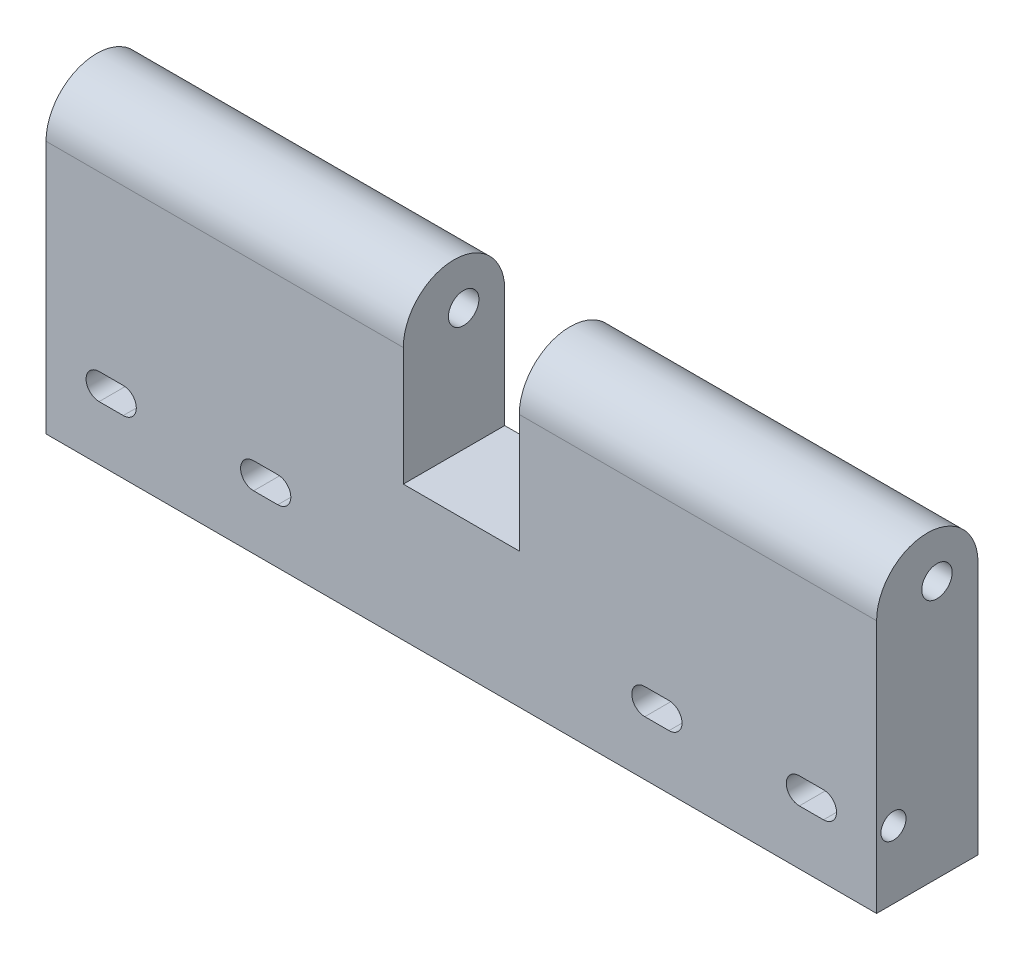
ISO-10303-21;
HEADER;
FILE_DESCRIPTION(('STEP AP214'),'2;1');
FILE_NAME('part.step','',(''),(''),'','','');
FILE_SCHEMA(('AUTOMOTIVE_DESIGN { 1 0 10303 214 1 1 1 1 }'));
ENDSEC;
DATA;
#1=APPLICATION_CONTEXT('core data for automotive mechanical design processes');
#2=APPLICATION_PROTOCOL_DEFINITION('international standard','automotive_design',2000,#1);
#3=PRODUCT_CONTEXT('',#1,'mechanical');
#4=PRODUCT('Part','Part','',(#3));
#5=PRODUCT_RELATED_PRODUCT_CATEGORY('part','',(#4));
#6=PRODUCT_DEFINITION_FORMATION('','',#4);
#7=PRODUCT_DEFINITION_CONTEXT('part definition',#1,'design');
#8=PRODUCT_DEFINITION('design','',#6,#7);
#9=PRODUCT_DEFINITION_SHAPE('','',#8);
#10=(LENGTH_UNIT() NAMED_UNIT(*) SI_UNIT(.MILLI.,.METRE.));
#11=(NAMED_UNIT(*) PLANE_ANGLE_UNIT() SI_UNIT($,.RADIAN.));
#12=(NAMED_UNIT(*) SI_UNIT($,.STERADIAN.) SOLID_ANGLE_UNIT());
#13=UNCERTAINTY_MEASURE_WITH_UNIT(LENGTH_MEASURE(1.E-05),#10,'distance_accuracy_value','');
#14=(GEOMETRIC_REPRESENTATION_CONTEXT(3) GLOBAL_UNCERTAINTY_ASSIGNED_CONTEXT((#13)) GLOBAL_UNIT_ASSIGNED_CONTEXT((#10,
#11,#12)) REPRESENTATION_CONTEXT('',''));
#15=CARTESIAN_POINT('',(0.,0.,0.));
#16=DIRECTION('',(0.,0.,1.));
#17=DIRECTION('',(1.,0.,0.));
#18=AXIS2_PLACEMENT_3D('',#15,#16,#17);
#19=CARTESIAN_POINT('',(-86.01,-14.0000000000001,21.));
#20=DIRECTION('',(1.,0.,0.));
#21=DIRECTION('',(0.,1.,0.));
#22=AXIS2_PLACEMENT_3D('',#19,#20,#21);
#23=PLANE('',#22);
#24=CARTESIAN_POINT('',(-86.01,0.,17.5));
#25=DIRECTION('',(-1.,0.,0.));
#26=DIRECTION('',(0.,-1.,0.));
#27=AXIS2_PLACEMENT_3D('',#24,#25,#26);
#28=CIRCLE('',#27,2.6);
#29=CARTESIAN_POINT('',(-86.01,-2.60000000000002,17.5));
#30=VERTEX_POINT('',#29);
#31=EDGE_CURVE('E431',#30,#30,#28,.T.);
#32=ORIENTED_EDGE('',*,*,#31,.F.);
#33=EDGE_LOOP('',(#32));
#34=FACE_BOUND('',#33,.T.);
#35=CARTESIAN_POINT('',(-86.01,39.3500000000002,8.50016556051523));
#36=DIRECTION('',(1.,0.,0.));
#37=DIRECTION('',(0.,0.,-1.));
#38=AXIS2_PLACEMENT_3D('',#35,#36,#37);
#39=CIRCLE('',#38,3.15);
#40=CARTESIAN_POINT('',(-86.01,39.3500000000002,5.35016556051523));
#41=VERTEX_POINT('',#40);
#42=EDGE_CURVE('E434',#41,#41,#39,.T.);
#43=ORIENTED_EDGE('',*,*,#42,.T.);
#44=EDGE_LOOP('',(#43));
#45=FACE_BOUND('',#44,.T.);
#46=DIRECTION('',(0.,-1.,0.));
#47=VECTOR('',#46,1.);
#48=CARTESIAN_POINT('',(-86.01,-14.0000000000001,21.));
#49=LINE('',#48,#47);
#50=CARTESIAN_POINT('',(-86.01,38.5000000000001,21.));
#51=VERTEX_POINT('',#50);
#52=CARTESIAN_POINT('',(-86.01,-14.0000000000001,21.));
#53=VERTEX_POINT('',#52);
#54=EDGE_CURVE('E213',#51,#53,#49,.T.);
#55=ORIENTED_EDGE('',*,*,#54,.F.);
#56=CARTESIAN_POINT('',(-86.01,38.5000000000001,10.5));
#57=DIRECTION('',(1.,0.,0.));
#58=DIRECTION('',(0.,0.,-1.));
#59=AXIS2_PLACEMENT_3D('',#56,#57,#58);
#60=CIRCLE('',#59,10.5);
#61=CARTESIAN_POINT('',(-86.01,38.5000000000001,0.));
#62=VERTEX_POINT('',#61);
#63=EDGE_CURVE('E198',#62,#51,#60,.T.);
#64=ORIENTED_EDGE('',*,*,#63,.F.);
#65=DIRECTION('',(0.,-1.,0.));
#66=VECTOR('',#65,1.);
#67=CARTESIAN_POINT('',(-86.01,-14.0000000000001,0.));
#68=LINE('',#67,#66);
#69=CARTESIAN_POINT('',(-86.01,-14.0000000000001,0.));
#70=VERTEX_POINT('',#69);
#71=EDGE_CURVE('E235',#62,#70,#68,.T.);
#72=ORIENTED_EDGE('',*,*,#71,.T.);
#73=DIRECTION('',(0.,0.,-1.));
#74=VECTOR('',#73,1.);
#75=CARTESIAN_POINT('',(-86.01,-14.0000000000001,21.));
#76=LINE('',#75,#74);
#77=EDGE_CURVE('E11',#53,#70,#76,.T.);
#78=ORIENTED_EDGE('',*,*,#77,.F.);
#79=EDGE_LOOP('',(#55,#64,#72,#78));
#80=FACE_BOUND('',#79,.T.);
#81=ADVANCED_FACE('F33',(#34,#45,#80),#23,.F.);
#82=CARTESIAN_POINT('',(86.01,-14.,21.));
#83=DIRECTION('',(-1.,0.,0.));
#84=DIRECTION('',(0.,0.,1.));
#85=AXIS2_PLACEMENT_3D('',#82,#83,#84);
#86=PLANE('',#85);
#87=CARTESIAN_POINT('',(86.01,1.14058058922876E-13,17.5000000000007));
#88=DIRECTION('',(1.,0.,0.));
#89=DIRECTION('',(0.,0.,-1.));
#90=AXIS2_PLACEMENT_3D('',#87,#88,#89);
#91=CIRCLE('',#90,2.6);
#92=CARTESIAN_POINT('',(86.01,1.14058058922876E-13,14.9000000000007));
#93=VERTEX_POINT('',#92);
#94=EDGE_CURVE('E444',#93,#93,#91,.T.);
#95=ORIENTED_EDGE('',*,*,#94,.F.);
#96=EDGE_LOOP('',(#95));
#97=FACE_BOUND('',#96,.T.);
#98=CARTESIAN_POINT('',(86.01,39.3500000000002,8.50016556051523));
#99=DIRECTION('',(1.,0.,0.));
#100=DIRECTION('',(0.,0.,-1.));
#101=AXIS2_PLACEMENT_3D('',#98,#99,#100);
#102=CIRCLE('',#101,3.15);
#103=CARTESIAN_POINT('',(86.01,39.3500000000002,5.35016556051523));
#104=VERTEX_POINT('',#103);
#105=EDGE_CURVE('E436',#104,#104,#102,.T.);
#106=ORIENTED_EDGE('',*,*,#105,.F.);
#107=EDGE_LOOP('',(#106));
#108=FACE_BOUND('',#107,.T.);
#109=CARTESIAN_POINT('',(86.01,38.5000000000001,10.5));
#110=DIRECTION('',(1.,0.,0.));
#111=DIRECTION('',(0.,0.,-1.));
#112=AXIS2_PLACEMENT_3D('',#109,#110,#111);
#113=CIRCLE('',#112,10.5);
#114=CARTESIAN_POINT('',(86.01,38.5000000000001,0.));
#115=VERTEX_POINT('',#114);
#116=CARTESIAN_POINT('',(86.01,38.5000000000001,21.));
#117=VERTEX_POINT('',#116);
#118=EDGE_CURVE('E209',#115,#117,#113,.T.);
#119=ORIENTED_EDGE('',*,*,#118,.T.);
#120=DIRECTION('',(0.,1.,0.));
#121=VECTOR('',#120,1.);
#122=CARTESIAN_POINT('',(86.01,-14.,21.));
#123=LINE('',#122,#121);
#124=CARTESIAN_POINT('',(86.01,-14.,21.));
#125=VERTEX_POINT('',#124);
#126=EDGE_CURVE('E222',#125,#117,#123,.T.);
#127=ORIENTED_EDGE('',*,*,#126,.F.);
#128=DIRECTION('',(0.,0.,-1.));
#129=VECTOR('',#128,1.);
#130=CARTESIAN_POINT('',(86.01,-14.,21.));
#131=LINE('',#130,#129);
#132=CARTESIAN_POINT('',(86.01,-14.,0.));
#133=VERTEX_POINT('',#132);
#134=EDGE_CURVE('E41',#125,#133,#131,.T.);
#135=ORIENTED_EDGE('',*,*,#134,.T.);
#136=DIRECTION('',(0.,1.,0.));
#137=VECTOR('',#136,1.);
#138=CARTESIAN_POINT('',(86.01,-14.,0.));
#139=LINE('',#138,#137);
#140=EDGE_CURVE('E225',#133,#115,#139,.T.);
#141=ORIENTED_EDGE('',*,*,#140,.T.);
#142=EDGE_LOOP('',(#119,#127,#135,#141));
#143=FACE_BOUND('',#142,.T.);
#144=ADVANCED_FACE('F246',(#97,#108,#143),#86,.F.);
#145=CARTESIAN_POINT('',(-12.01,49.,0.));
#146=DIRECTION('',(-1.,0.,0.));
#147=DIRECTION('',(0.,-1.,0.));
#148=AXIS2_PLACEMENT_3D('',#145,#146,#147);
#149=PLANE('',#148);
#150=CARTESIAN_POINT('',(-12.01,39.3500000000002,8.50016556051523));
#151=DIRECTION('',(-1.,0.,0.));
#152=DIRECTION('',(0.,-1.,0.));
#153=AXIS2_PLACEMENT_3D('',#150,#151,#152);
#154=CIRCLE('',#153,3.15);
#155=CARTESIAN_POINT('',(-12.01,36.2000000000002,8.50016556051523));
#156=VERTEX_POINT('',#155);
#157=EDGE_CURVE('E439',#156,#156,#154,.T.);
#158=ORIENTED_EDGE('',*,*,#157,.T.);
#159=EDGE_LOOP('',(#158));
#160=FACE_BOUND('',#159,.T.);
#161=CARTESIAN_POINT('',(-12.01,38.5000000000001,10.5));
#162=DIRECTION('',(-1.,0.,0.));
#163=DIRECTION('',(0.,-1.,0.));
#164=AXIS2_PLACEMENT_3D('',#161,#162,#163);
#165=CIRCLE('',#164,10.5);
#166=CARTESIAN_POINT('',(-12.01,38.5000000000001,21.));
#167=VERTEX_POINT('',#166);
#168=CARTESIAN_POINT('',(-12.01,38.5000000000001,0.));
#169=VERTEX_POINT('',#168);
#170=EDGE_CURVE('E260',#167,#169,#165,.T.);
#171=ORIENTED_EDGE('',*,*,#170,.F.);
#172=DIRECTION('',(0.,-1.,0.));
#173=VECTOR('',#172,1.);
#174=CARTESIAN_POINT('',(-12.01,49.,21.));
#175=LINE('',#174,#173);
#176=CARTESIAN_POINT('',(-12.01,14.,21.));
#177=VERTEX_POINT('',#176);
#178=EDGE_CURVE('E215',#167,#177,#175,.T.);
#179=ORIENTED_EDGE('',*,*,#178,.T.);
#180=DIRECTION('',(0.,0.,-1.));
#181=VECTOR('',#180,1.);
#182=CARTESIAN_POINT('',(-12.01,14.,0.));
#183=LINE('',#182,#181);
#184=CARTESIAN_POINT('',(-12.01,14.,0.));
#185=VERTEX_POINT('',#184);
#186=EDGE_CURVE('E266',#177,#185,#183,.T.);
#187=ORIENTED_EDGE('',*,*,#186,.T.);
#188=DIRECTION('',(0.,-1.,0.));
#189=VECTOR('',#188,1.);
#190=CARTESIAN_POINT('',(-12.01,49.,0.));
#191=LINE('',#190,#189);
#192=EDGE_CURVE('E269',#169,#185,#191,.T.);
#193=ORIENTED_EDGE('',*,*,#192,.F.);
#194=EDGE_LOOP('',(#171,#179,#187,#193));
#195=FACE_BOUND('',#194,.T.);
#196=ADVANCED_FACE('F425',(#160,#195),#149,.F.);
#197=CARTESIAN_POINT('',(12.01,49.,0.));
#198=DIRECTION('',(1.,0.,0.));
#199=DIRECTION('',(0.,1.,0.));
#200=AXIS2_PLACEMENT_3D('',#197,#198,#199);
#201=PLANE('',#200);
#202=CARTESIAN_POINT('',(12.01,39.3500000000002,8.50016556051523));
#203=DIRECTION('',(1.,0.,0.));
#204=DIRECTION('',(0.,1.,0.));
#205=AXIS2_PLACEMENT_3D('',#202,#203,#204);
#206=CIRCLE('',#205,3.15);
#207=CARTESIAN_POINT('',(12.01,42.5000000000002,8.50016556051523));
#208=VERTEX_POINT('',#207);
#209=EDGE_CURVE('E36',#208,#208,#206,.T.);
#210=ORIENTED_EDGE('',*,*,#209,.T.);
#211=EDGE_LOOP('',(#210));
#212=FACE_BOUND('',#211,.T.);
#213=DIRECTION('',(0.,-1.,0.));
#214=VECTOR('',#213,1.);
#215=CARTESIAN_POINT('',(12.01,49.,21.));
#216=LINE('',#215,#214);
#217=CARTESIAN_POINT('',(12.01,38.5000000000001,21.));
#218=VERTEX_POINT('',#217);
#219=CARTESIAN_POINT('',(12.01,14.,21.));
#220=VERTEX_POINT('',#219);
#221=EDGE_CURVE('E48',#218,#220,#216,.T.);
#222=ORIENTED_EDGE('',*,*,#221,.F.);
#223=CARTESIAN_POINT('',(12.01,38.5000000000001,10.5));
#224=DIRECTION('',(1.,0.,0.));
#225=DIRECTION('',(0.,1.,0.));
#226=AXIS2_PLACEMENT_3D('',#223,#224,#225);
#227=CIRCLE('',#226,10.5);
#228=CARTESIAN_POINT('',(12.01,38.5000000000001,0.));
#229=VERTEX_POINT('',#228);
#230=EDGE_CURVE('E256',#229,#218,#227,.T.);
#231=ORIENTED_EDGE('',*,*,#230,.F.);
#232=DIRECTION('',(0.,-1.,0.));
#233=VECTOR('',#232,1.);
#234=CARTESIAN_POINT('',(12.01,49.,0.));
#235=LINE('',#234,#233);
#236=CARTESIAN_POINT('',(12.01,14.,0.));
#237=VERTEX_POINT('',#236);
#238=EDGE_CURVE('E56',#229,#237,#235,.T.);
#239=ORIENTED_EDGE('',*,*,#238,.T.);
#240=DIRECTION('',(0.,0.,1.));
#241=VECTOR('',#240,1.);
#242=CARTESIAN_POINT('',(12.01,14.,0.));
#243=LINE('',#242,#241);
#244=EDGE_CURVE('E262',#237,#220,#243,.T.);
#245=ORIENTED_EDGE('',*,*,#244,.T.);
#246=EDGE_LOOP('',(#222,#231,#239,#245));
#247=FACE_BOUND('',#246,.T.);
#248=ADVANCED_FACE('F464',(#212,#247),#201,.F.);
#249=CARTESIAN_POINT('',(86.01,14.0000000000001,21.));
#250=DIRECTION('',(0.,-1.,0.));
#251=DIRECTION('',(1.,0.,0.));
#252=AXIS2_PLACEMENT_3D('',#249,#250,#251);
#253=PLANE('',#252);
#254=ORIENTED_EDGE('',*,*,#244,.F.);
#255=DIRECTION('',(-1.,0.,0.));
#256=VECTOR('',#255,1.);
#257=CARTESIAN_POINT('',(86.01,14.0000000000001,0.));
#258=LINE('',#257,#256);
#259=EDGE_CURVE('E220',#237,#185,#258,.T.);
#260=ORIENTED_EDGE('',*,*,#259,.T.);
#261=ORIENTED_EDGE('',*,*,#186,.F.);
#262=DIRECTION('',(-1.,0.,0.));
#263=VECTOR('',#262,1.);
#264=CARTESIAN_POINT('',(86.01,14.0000000000001,21.));
#265=LINE('',#264,#263);
#266=EDGE_CURVE('E233',#220,#177,#265,.T.);
#267=ORIENTED_EDGE('',*,*,#266,.F.);
#268=EDGE_LOOP('',(#254,#260,#261,#267));
#269=FACE_BOUND('',#268,.T.);
#270=ADVANCED_FACE('F462',(#269),#253,.F.);
#271=CARTESIAN_POINT('',(0.,0.,21.));
#272=DIRECTION('',(0.,0.,1.));
#273=DIRECTION('',(1.,0.,0.));
#274=AXIS2_PLACEMENT_3D('',#271,#272,#273);
#275=PLANE('',#274);
#276=DIRECTION('',(1.,0.,0.));
#277=VECTOR('',#276,1.);
#278=CARTESIAN_POINT('',(-86.01,38.5000000000001,21.));
#279=LINE('',#278,#277);
#280=EDGE_CURVE('E201',#51,#167,#279,.T.);
#281=ORIENTED_EDGE('',*,*,#280,.F.);
#282=ORIENTED_EDGE('',*,*,#54,.T.);
#283=DIRECTION('',(1.,0.,0.));
#284=VECTOR('',#283,1.);
#285=CARTESIAN_POINT('',(86.01,-14.,21.));
#286=LINE('',#285,#284);
#287=EDGE_CURVE('E219',#53,#125,#286,.T.);
#288=ORIENTED_EDGE('',*,*,#287,.T.);
#289=ORIENTED_EDGE('',*,*,#126,.T.);
#290=EDGE_CURVE('E216',#218,#117,#279,.T.);
#291=ORIENTED_EDGE('',*,*,#290,.F.);
#292=ORIENTED_EDGE('',*,*,#221,.T.);
#293=ORIENTED_EDGE('',*,*,#266,.T.);
#294=ORIENTED_EDGE('',*,*,#178,.F.);
#295=EDGE_LOOP('',(#281,#282,#288,#289,#291,#292,#293,#294));
#296=FACE_BOUND('',#295,.T.);
#297=DIRECTION('',(-1.,0.,0.));
#298=VECTOR('',#297,1.);
#299=CARTESIAN_POINT('',(75.01,2.69999999999993,21.));
#300=LINE('',#299,#298);
#301=CARTESIAN_POINT('',(75.01,2.69999999999993,21.));
#302=VERTEX_POINT('',#301);
#303=CARTESIAN_POINT('',(70.01,2.69999999999995,21.));
#304=VERTEX_POINT('',#303);
#305=EDGE_CURVE('E368',#302,#304,#300,.T.);
#306=ORIENTED_EDGE('',*,*,#305,.F.);
#307=CARTESIAN_POINT('',(75.01,0.,21.));
#308=DIRECTION('',(0.,0.,1.));
#309=DIRECTION('',(1.,0.,0.));
#310=AXIS2_PLACEMENT_3D('',#307,#308,#309);
#311=CIRCLE('',#310,2.69999999999998);
#312=CARTESIAN_POINT('',(75.01,-2.70000000000004,21.));
#313=VERTEX_POINT('',#312);
#314=EDGE_CURVE('E366',#313,#302,#311,.T.);
#315=ORIENTED_EDGE('',*,*,#314,.F.);
#316=DIRECTION('',(1.,0.,0.));
#317=VECTOR('',#316,1.);
#318=CARTESIAN_POINT('',(75.01,-2.70000000000004,21.));
#319=LINE('',#318,#317);
#320=CARTESIAN_POINT('',(70.01,-2.70000000000004,21.));
#321=VERTEX_POINT('',#320);
#322=EDGE_CURVE('E374',#321,#313,#319,.T.);
#323=ORIENTED_EDGE('',*,*,#322,.F.);
#324=CARTESIAN_POINT('',(70.01,0.,21.));
#325=DIRECTION('',(0.,0.,1.));
#326=DIRECTION('',(1.,0.,0.));
#327=AXIS2_PLACEMENT_3D('',#324,#325,#326);
#328=CIRCLE('',#327,2.69999999999998);
#329=EDGE_CURVE('E371',#304,#321,#328,.T.);
#330=ORIENTED_EDGE('',*,*,#329,.F.);
#331=EDGE_LOOP('',(#306,#315,#323,#330));
#332=FACE_BOUND('',#331,.T.);
#333=DIRECTION('',(-1.,0.,0.));
#334=VECTOR('',#333,1.);
#335=CARTESIAN_POINT('',(43.01,2.69999999999995,21.));
#336=LINE('',#335,#334);
#337=CARTESIAN_POINT('',(43.01,2.69999999999995,21.));
#338=VERTEX_POINT('',#337);
#339=CARTESIAN_POINT('',(38.01,2.69999999999997,21.));
#340=VERTEX_POINT('',#339);
#341=EDGE_CURVE('E337',#338,#340,#336,.T.);
#342=ORIENTED_EDGE('',*,*,#341,.F.);
#343=CARTESIAN_POINT('',(43.01,0.,21.));
#344=DIRECTION('',(0.,0.,1.));
#345=DIRECTION('',(1.,0.,0.));
#346=AXIS2_PLACEMENT_3D('',#343,#344,#345);
#347=CIRCLE('',#346,2.69999999999999);
#348=CARTESIAN_POINT('',(43.01,-2.70000000000002,21.));
#349=VERTEX_POINT('',#348);
#350=EDGE_CURVE('E335',#349,#338,#347,.T.);
#351=ORIENTED_EDGE('',*,*,#350,.F.);
#352=DIRECTION('',(1.,0.,0.));
#353=VECTOR('',#352,1.);
#354=CARTESIAN_POINT('',(43.01,-2.70000000000002,21.));
#355=LINE('',#354,#353);
#356=CARTESIAN_POINT('',(38.01,-2.70000000000002,21.));
#357=VERTEX_POINT('',#356);
#358=EDGE_CURVE('E343',#357,#349,#355,.T.);
#359=ORIENTED_EDGE('',*,*,#358,.F.);
#360=CARTESIAN_POINT('',(38.01,0.,21.));
#361=DIRECTION('',(0.,0.,1.));
#362=DIRECTION('',(1.,0.,0.));
#363=AXIS2_PLACEMENT_3D('',#360,#361,#362);
#364=CIRCLE('',#363,2.69999999999999);
#365=EDGE_CURVE('E340',#340,#357,#364,.T.);
#366=ORIENTED_EDGE('',*,*,#365,.F.);
#367=EDGE_LOOP('',(#342,#351,#359,#366));
#368=FACE_BOUND('',#367,.T.);
#369=DIRECTION('',(-1.,0.,0.));
#370=VECTOR('',#369,1.);
#371=CARTESIAN_POINT('',(-70.01,2.69999999999994,21.));
#372=LINE('',#371,#370);
#373=CARTESIAN_POINT('',(-70.01,2.69999999999994,21.));
#374=VERTEX_POINT('',#373);
#375=CARTESIAN_POINT('',(-75.01,2.69999999999994,21.));
#376=VERTEX_POINT('',#375);
#377=EDGE_CURVE('E306',#374,#376,#372,.T.);
#378=ORIENTED_EDGE('',*,*,#377,.F.);
#379=CARTESIAN_POINT('',(-70.01,0.,21.));
#380=DIRECTION('',(0.,0.,1.));
#381=DIRECTION('',(1.,0.,0.));
#382=AXIS2_PLACEMENT_3D('',#379,#380,#381);
#383=CIRCLE('',#382,2.7);
#384=CARTESIAN_POINT('',(-70.01,-2.70000000000006,21.));
#385=VERTEX_POINT('',#384);
#386=EDGE_CURVE('E304',#385,#374,#383,.T.);
#387=ORIENTED_EDGE('',*,*,#386,.F.);
#388=DIRECTION('',(1.,0.,0.));
#389=VECTOR('',#388,1.);
#390=CARTESIAN_POINT('',(-70.01,-2.70000000000006,21.));
#391=LINE('',#390,#389);
#392=CARTESIAN_POINT('',(-75.01,-2.70000000000006,21.));
#393=VERTEX_POINT('',#392);
#394=EDGE_CURVE('E312',#393,#385,#391,.T.);
#395=ORIENTED_EDGE('',*,*,#394,.F.);
#396=CARTESIAN_POINT('',(-75.01,0.,21.));
#397=DIRECTION('',(0.,0.,1.));
#398=DIRECTION('',(1.,0.,0.));
#399=AXIS2_PLACEMENT_3D('',#396,#397,#398);
#400=CIRCLE('',#399,2.7);
#401=EDGE_CURVE('E309',#376,#393,#400,.T.);
#402=ORIENTED_EDGE('',*,*,#401,.F.);
#403=EDGE_LOOP('',(#378,#387,#395,#402));
#404=FACE_BOUND('',#403,.T.);
#405=DIRECTION('',(1.,0.,0.));
#406=VECTOR('',#405,1.);
#407=CARTESIAN_POINT('',(-43.01,-2.70000000000003,21.));
#408=LINE('',#407,#406);
#409=CARTESIAN_POINT('',(-43.01,-2.70000000000003,21.));
#410=VERTEX_POINT('',#409);
#411=CARTESIAN_POINT('',(-38.01,-2.70000000000003,21.));
#412=VERTEX_POINT('',#411);
#413=EDGE_CURVE('E275',#410,#412,#408,.T.);
#414=ORIENTED_EDGE('',*,*,#413,.F.);
#415=CARTESIAN_POINT('',(-43.01,0.,21.));
#416=DIRECTION('',(0.,0.,1.));
#417=DIRECTION('',(1.,0.,0.));
#418=AXIS2_PLACEMENT_3D('',#415,#416,#417);
#419=CIRCLE('',#418,2.7);
#420=CARTESIAN_POINT('',(-43.01,2.69999999999997,21.));
#421=VERTEX_POINT('',#420);
#422=EDGE_CURVE('E273',#421,#410,#419,.T.);
#423=ORIENTED_EDGE('',*,*,#422,.F.);
#424=DIRECTION('',(-1.,0.,0.));
#425=VECTOR('',#424,1.);
#426=CARTESIAN_POINT('',(-43.01,2.69999999999997,21.));
#427=LINE('',#426,#425);
#428=CARTESIAN_POINT('',(-38.01,2.69999999999997,21.));
#429=VERTEX_POINT('',#428);
#430=EDGE_CURVE('E281',#429,#421,#427,.T.);
#431=ORIENTED_EDGE('',*,*,#430,.F.);
#432=CARTESIAN_POINT('',(-38.01,0.,21.));
#433=DIRECTION('',(0.,0.,1.));
#434=DIRECTION('',(1.,0.,0.));
#435=AXIS2_PLACEMENT_3D('',#432,#433,#434);
#436=CIRCLE('',#435,2.7);
#437=EDGE_CURVE('E278',#412,#429,#436,.T.);
#438=ORIENTED_EDGE('',*,*,#437,.F.);
#439=EDGE_LOOP('',(#414,#423,#431,#438));
#440=FACE_BOUND('',#439,.T.);
#441=ADVANCED_FACE('F211',(#296,#332,#368,#404,#440),#275,.T.);
#442=CARTESIAN_POINT('',(0.,0.,0.));
#443=DIRECTION('',(0.,0.,1.));
#444=DIRECTION('',(1.,0.,0.));
#445=AXIS2_PLACEMENT_3D('',#442,#443,#444);
#446=PLANE('',#445);
#447=CARTESIAN_POINT('',(-70.01,0.,0.));
#448=DIRECTION('',(0.,0.,1.));
#449=DIRECTION('',(1.,0.,0.));
#450=AXIS2_PLACEMENT_3D('',#447,#448,#449);
#451=CIRCLE('',#450,2.7);
#452=CARTESIAN_POINT('',(-70.01,-2.70000000000006,0.));
#453=VERTEX_POINT('',#452);
#454=CARTESIAN_POINT('',(-70.01,2.69999999999994,0.));
#455=VERTEX_POINT('',#454);
#456=EDGE_CURVE('E303',#453,#455,#451,.T.);
#457=ORIENTED_EDGE('',*,*,#456,.T.);
#458=DIRECTION('',(-1.,0.,0.));
#459=VECTOR('',#458,1.);
#460=CARTESIAN_POINT('',(-70.01,2.69999999999994,0.));
#461=LINE('',#460,#459);
#462=CARTESIAN_POINT('',(-75.01,2.69999999999994,0.));
#463=VERTEX_POINT('',#462);
#464=EDGE_CURVE('E317',#455,#463,#461,.T.);
#465=ORIENTED_EDGE('',*,*,#464,.T.);
#466=CARTESIAN_POINT('',(-75.01,0.,0.));
#467=DIRECTION('',(0.,0.,1.));
#468=DIRECTION('',(1.,0.,0.));
#469=AXIS2_PLACEMENT_3D('',#466,#467,#468);
#470=CIRCLE('',#469,2.7);
#471=CARTESIAN_POINT('',(-75.01,-2.70000000000006,0.));
#472=VERTEX_POINT('',#471);
#473=EDGE_CURVE('E320',#463,#472,#470,.T.);
#474=ORIENTED_EDGE('',*,*,#473,.T.);
#475=DIRECTION('',(1.,0.,0.));
#476=VECTOR('',#475,1.);
#477=CARTESIAN_POINT('',(-70.01,-2.70000000000006,0.));
#478=LINE('',#477,#476);
#479=EDGE_CURVE('E307',#472,#453,#478,.T.);
#480=ORIENTED_EDGE('',*,*,#479,.T.);
#481=EDGE_LOOP('',(#457,#465,#474,#480));
#482=FACE_BOUND('',#481,.T.);
#483=CARTESIAN_POINT('',(75.01,0.,0.));
#484=DIRECTION('',(0.,0.,1.));
#485=DIRECTION('',(1.,0.,0.));
#486=AXIS2_PLACEMENT_3D('',#483,#484,#485);
#487=CIRCLE('',#486,2.69999999999998);
#488=CARTESIAN_POINT('',(75.01,-2.70000000000004,0.));
#489=VERTEX_POINT('',#488);
#490=CARTESIAN_POINT('',(75.01,2.69999999999993,0.));
#491=VERTEX_POINT('',#490);
#492=EDGE_CURVE('E365',#489,#491,#487,.T.);
#493=ORIENTED_EDGE('',*,*,#492,.T.);
#494=DIRECTION('',(-1.,0.,0.));
#495=VECTOR('',#494,1.);
#496=CARTESIAN_POINT('',(75.01,2.69999999999993,0.));
#497=LINE('',#496,#495);
#498=CARTESIAN_POINT('',(70.01,2.69999999999995,0.));
#499=VERTEX_POINT('',#498);
#500=EDGE_CURVE('E379',#491,#499,#497,.T.);
#501=ORIENTED_EDGE('',*,*,#500,.T.);
#502=CARTESIAN_POINT('',(70.01,0.,0.));
#503=DIRECTION('',(0.,0.,1.));
#504=DIRECTION('',(1.,0.,0.));
#505=AXIS2_PLACEMENT_3D('',#502,#503,#504);
#506=CIRCLE('',#505,2.69999999999998);
#507=CARTESIAN_POINT('',(70.01,-2.70000000000004,0.));
#508=VERTEX_POINT('',#507);
#509=EDGE_CURVE('E382',#499,#508,#506,.T.);
#510=ORIENTED_EDGE('',*,*,#509,.T.);
#511=DIRECTION('',(1.,0.,0.));
#512=VECTOR('',#511,1.);
#513=CARTESIAN_POINT('',(75.01,-2.70000000000004,0.));
#514=LINE('',#513,#512);
#515=EDGE_CURVE('E369',#508,#489,#514,.T.);
#516=ORIENTED_EDGE('',*,*,#515,.T.);
#517=EDGE_LOOP('',(#493,#501,#510,#516));
#518=FACE_BOUND('',#517,.T.);
#519=ORIENTED_EDGE('',*,*,#71,.F.);
#520=DIRECTION('',(1.,0.,0.));
#521=VECTOR('',#520,1.);
#522=CARTESIAN_POINT('',(-86.01,38.5000000000001,0.));
#523=LINE('',#522,#521);
#524=EDGE_CURVE('E204',#62,#169,#523,.T.);
#525=ORIENTED_EDGE('',*,*,#524,.T.);
#526=ORIENTED_EDGE('',*,*,#192,.T.);
#527=ORIENTED_EDGE('',*,*,#259,.F.);
#528=ORIENTED_EDGE('',*,*,#238,.F.);
#529=EDGE_CURVE('E208',#229,#115,#523,.T.);
#530=ORIENTED_EDGE('',*,*,#529,.T.);
#531=ORIENTED_EDGE('',*,*,#140,.F.);
#532=DIRECTION('',(1.,0.,0.));
#533=VECTOR('',#532,1.);
#534=CARTESIAN_POINT('',(86.01,-14.,0.));
#535=LINE('',#534,#533);
#536=EDGE_CURVE('E237',#70,#133,#535,.T.);
#537=ORIENTED_EDGE('',*,*,#536,.F.);
#538=EDGE_LOOP('',(#519,#525,#526,#527,#528,#530,#531,#537));
#539=FACE_BOUND('',#538,.T.);
#540=CARTESIAN_POINT('',(43.01,0.,0.));
#541=DIRECTION('',(0.,0.,1.));
#542=DIRECTION('',(1.,0.,0.));
#543=AXIS2_PLACEMENT_3D('',#540,#541,#542);
#544=CIRCLE('',#543,2.69999999999999);
#545=CARTESIAN_POINT('',(43.01,-2.70000000000002,0.));
#546=VERTEX_POINT('',#545);
#547=CARTESIAN_POINT('',(43.01,2.69999999999995,0.));
#548=VERTEX_POINT('',#547);
#549=EDGE_CURVE('E334',#546,#548,#544,.T.);
#550=ORIENTED_EDGE('',*,*,#549,.T.);
#551=DIRECTION('',(-1.,0.,0.));
#552=VECTOR('',#551,1.);
#553=CARTESIAN_POINT('',(43.01,2.69999999999995,0.));
#554=LINE('',#553,#552);
#555=CARTESIAN_POINT('',(38.01,2.69999999999997,0.));
#556=VERTEX_POINT('',#555);
#557=EDGE_CURVE('E348',#548,#556,#554,.T.);
#558=ORIENTED_EDGE('',*,*,#557,.T.);
#559=CARTESIAN_POINT('',(38.01,0.,0.));
#560=DIRECTION('',(0.,0.,1.));
#561=DIRECTION('',(1.,0.,0.));
#562=AXIS2_PLACEMENT_3D('',#559,#560,#561);
#563=CIRCLE('',#562,2.69999999999999);
#564=CARTESIAN_POINT('',(38.01,-2.70000000000002,0.));
#565=VERTEX_POINT('',#564);
#566=EDGE_CURVE('E351',#556,#565,#563,.T.);
#567=ORIENTED_EDGE('',*,*,#566,.T.);
#568=DIRECTION('',(1.,0.,0.));
#569=VECTOR('',#568,1.);
#570=CARTESIAN_POINT('',(43.01,-2.70000000000002,0.));
#571=LINE('',#570,#569);
#572=EDGE_CURVE('E338',#565,#546,#571,.T.);
#573=ORIENTED_EDGE('',*,*,#572,.T.);
#574=EDGE_LOOP('',(#550,#558,#567,#573));
#575=FACE_BOUND('',#574,.T.);
#576=CARTESIAN_POINT('',(-43.01,0.,0.));
#577=DIRECTION('',(0.,0.,1.));
#578=DIRECTION('',(1.,0.,0.));
#579=AXIS2_PLACEMENT_3D('',#576,#577,#578);
#580=CIRCLE('',#579,2.7);
#581=CARTESIAN_POINT('',(-43.01,2.69999999999997,0.));
#582=VERTEX_POINT('',#581);
#583=CARTESIAN_POINT('',(-43.01,-2.70000000000003,0.));
#584=VERTEX_POINT('',#583);
#585=EDGE_CURVE('E272',#582,#584,#580,.T.);
#586=ORIENTED_EDGE('',*,*,#585,.T.);
#587=DIRECTION('',(1.,0.,0.));
#588=VECTOR('',#587,1.);
#589=CARTESIAN_POINT('',(-43.01,-2.70000000000003,0.));
#590=LINE('',#589,#588);
#591=CARTESIAN_POINT('',(-38.01,-2.70000000000003,0.));
#592=VERTEX_POINT('',#591);
#593=EDGE_CURVE('E286',#584,#592,#590,.T.);
#594=ORIENTED_EDGE('',*,*,#593,.T.);
#595=CARTESIAN_POINT('',(-38.01,0.,0.));
#596=DIRECTION('',(0.,0.,1.));
#597=DIRECTION('',(1.,0.,0.));
#598=AXIS2_PLACEMENT_3D('',#595,#596,#597);
#599=CIRCLE('',#598,2.7);
#600=CARTESIAN_POINT('',(-38.01,2.69999999999997,0.));
#601=VERTEX_POINT('',#600);
#602=EDGE_CURVE('E289',#592,#601,#599,.T.);
#603=ORIENTED_EDGE('',*,*,#602,.T.);
#604=DIRECTION('',(-1.,0.,0.));
#605=VECTOR('',#604,1.);
#606=CARTESIAN_POINT('',(-43.01,2.69999999999997,0.));
#607=LINE('',#606,#605);
#608=EDGE_CURVE('E276',#601,#582,#607,.T.);
#609=ORIENTED_EDGE('',*,*,#608,.T.);
#610=EDGE_LOOP('',(#586,#594,#603,#609));
#611=FACE_BOUND('',#610,.T.);
#612=ADVANCED_FACE('F251',(#482,#518,#539,#575,#611),#446,.F.);
#613=CARTESIAN_POINT('',(86.01,-14.,21.));
#614=DIRECTION('',(0.,1.,0.));
#615=DIRECTION('',(-1.,0.,0.));
#616=AXIS2_PLACEMENT_3D('',#613,#614,#615);
#617=PLANE('',#616);
#618=ORIENTED_EDGE('',*,*,#536,.T.);
#619=ORIENTED_EDGE('',*,*,#134,.F.);
#620=ORIENTED_EDGE('',*,*,#287,.F.);
#621=ORIENTED_EDGE('',*,*,#77,.T.);
#622=EDGE_LOOP('',(#618,#619,#620,#621));
#623=FACE_BOUND('',#622,.T.);
#624=ADVANCED_FACE('F452',(#623),#617,.F.);
#625=CARTESIAN_POINT('',(75.01,0.,21.));
#626=DIRECTION('',(0.,0.,-1.));
#627=DIRECTION('',(-1.,0.,0.));
#628=AXIS2_PLACEMENT_3D('',#625,#626,#627);
#629=CYLINDRICAL_SURFACE('',#628,2.69999999999998);
#630=ORIENTED_EDGE('',*,*,#492,.F.);
#631=DIRECTION('',(0.,0.,-1.));
#632=VECTOR('',#631,1.);
#633=CARTESIAN_POINT('',(75.01,-2.70000000000004,21.));
#634=LINE('',#633,#632);
#635=EDGE_CURVE('E376',#313,#489,#634,.T.);
#636=ORIENTED_EDGE('',*,*,#635,.F.);
#637=ORIENTED_EDGE('',*,*,#314,.T.);
#638=DIRECTION('',(0.,0.,-1.));
#639=VECTOR('',#638,1.);
#640=CARTESIAN_POINT('',(75.01,2.69999999999993,21.));
#641=LINE('',#640,#639);
#642=EDGE_CURVE('E228',#302,#491,#641,.T.);
#643=ORIENTED_EDGE('',*,*,#642,.T.);
#644=EDGE_LOOP('',(#630,#636,#637,#643));
#645=FACE_BOUND('',#644,.T.);
#646=ADVANCED_FACE('F397',(#645),#629,.F.);
#647=CARTESIAN_POINT('',(75.01,2.69999999999993,21.));
#648=DIRECTION('',(0.,-1.,0.));
#649=DIRECTION('',(0.,0.,-1.));
#650=AXIS2_PLACEMENT_3D('',#647,#648,#649);
#651=PLANE('',#650);
#652=ORIENTED_EDGE('',*,*,#500,.F.);
#653=ORIENTED_EDGE('',*,*,#642,.F.);
#654=ORIENTED_EDGE('',*,*,#305,.T.);
#655=DIRECTION('',(0.,0.,-1.));
#656=VECTOR('',#655,1.);
#657=CARTESIAN_POINT('',(70.01,2.69999999999995,21.));
#658=LINE('',#657,#656);
#659=EDGE_CURVE('E390',#304,#499,#658,.T.);
#660=ORIENTED_EDGE('',*,*,#659,.T.);
#661=EDGE_LOOP('',(#652,#653,#654,#660));
#662=FACE_BOUND('',#661,.T.);
#663=ADVANCED_FACE('F408',(#662),#651,.T.);
#664=CARTESIAN_POINT('',(70.01,0.,21.));
#665=DIRECTION('',(0.,0.,-1.));
#666=DIRECTION('',(-1.,0.,0.));
#667=AXIS2_PLACEMENT_3D('',#664,#665,#666);
#668=CYLINDRICAL_SURFACE('',#667,2.69999999999998);
#669=ORIENTED_EDGE('',*,*,#509,.F.);
#670=ORIENTED_EDGE('',*,*,#659,.F.);
#671=ORIENTED_EDGE('',*,*,#329,.T.);
#672=DIRECTION('',(0.,0.,-1.));
#673=VECTOR('',#672,1.);
#674=CARTESIAN_POINT('',(70.01,-2.70000000000004,21.));
#675=LINE('',#674,#673);
#676=EDGE_CURVE('E389',#321,#508,#675,.T.);
#677=ORIENTED_EDGE('',*,*,#676,.T.);
#678=EDGE_LOOP('',(#669,#670,#671,#677));
#679=FACE_BOUND('',#678,.T.);
#680=ADVANCED_FACE('F410',(#679),#668,.F.);
#681=CARTESIAN_POINT('',(75.01,-2.70000000000004,21.));
#682=DIRECTION('',(0.,1.,0.));
#683=DIRECTION('',(-1.,0.,0.));
#684=AXIS2_PLACEMENT_3D('',#681,#682,#683);
#685=PLANE('',#684);
#686=ORIENTED_EDGE('',*,*,#515,.F.);
#687=ORIENTED_EDGE('',*,*,#676,.F.);
#688=ORIENTED_EDGE('',*,*,#322,.T.);
#689=ORIENTED_EDGE('',*,*,#635,.T.);
#690=EDGE_LOOP('',(#686,#687,#688,#689));
#691=FACE_BOUND('',#690,.T.);
#692=ADVANCED_FACE('F404',(#691),#685,.T.);
#693=CARTESIAN_POINT('',(43.01,0.,21.));
#694=DIRECTION('',(0.,0.,-1.));
#695=DIRECTION('',(-1.,0.,0.));
#696=AXIS2_PLACEMENT_3D('',#693,#694,#695);
#697=CYLINDRICAL_SURFACE('',#696,2.69999999999999);
#698=ORIENTED_EDGE('',*,*,#549,.F.);
#699=DIRECTION('',(0.,0.,-1.));
#700=VECTOR('',#699,1.);
#701=CARTESIAN_POINT('',(43.01,-2.70000000000002,21.));
#702=LINE('',#701,#700);
#703=EDGE_CURVE('E345',#349,#546,#702,.T.);
#704=ORIENTED_EDGE('',*,*,#703,.F.);
#705=ORIENTED_EDGE('',*,*,#350,.T.);
#706=DIRECTION('',(0.,0.,-1.));
#707=VECTOR('',#706,1.);
#708=CARTESIAN_POINT('',(43.01,2.69999999999995,21.));
#709=LINE('',#708,#707);
#710=EDGE_CURVE('E362',#338,#548,#709,.T.);
#711=ORIENTED_EDGE('',*,*,#710,.T.);
#712=EDGE_LOOP('',(#698,#704,#705,#711));
#713=FACE_BOUND('',#712,.T.);
#714=ADVANCED_FACE('F417',(#713),#697,.F.);
#715=CARTESIAN_POINT('',(43.01,2.69999999999995,21.));
#716=DIRECTION('',(0.,-1.,0.));
#717=DIRECTION('',(0.,0.,-1.));
#718=AXIS2_PLACEMENT_3D('',#715,#716,#717);
#719=PLANE('',#718);
#720=ORIENTED_EDGE('',*,*,#557,.F.);
#721=ORIENTED_EDGE('',*,*,#710,.F.);
#722=ORIENTED_EDGE('',*,*,#341,.T.);
#723=DIRECTION('',(0.,0.,-1.));
#724=VECTOR('',#723,1.);
#725=CARTESIAN_POINT('',(38.01,2.69999999999997,21.));
#726=LINE('',#725,#724);
#727=EDGE_CURVE('E360',#340,#556,#726,.T.);
#728=ORIENTED_EDGE('',*,*,#727,.T.);
#729=EDGE_LOOP('',(#720,#721,#722,#728));
#730=FACE_BOUND('',#729,.T.);
#731=ADVANCED_FACE('F626',(#730),#719,.T.);
#732=CARTESIAN_POINT('',(38.01,0.,21.));
#733=DIRECTION('',(0.,0.,-1.));
#734=DIRECTION('',(-1.,0.,0.));
#735=AXIS2_PLACEMENT_3D('',#732,#733,#734);
#736=CYLINDRICAL_SURFACE('',#735,2.69999999999999);
#737=ORIENTED_EDGE('',*,*,#566,.F.);
#738=ORIENTED_EDGE('',*,*,#727,.F.);
#739=ORIENTED_EDGE('',*,*,#365,.T.);
#740=DIRECTION('',(0.,0.,-1.));
#741=VECTOR('',#740,1.);
#742=CARTESIAN_POINT('',(38.01,-2.70000000000002,21.));
#743=LINE('',#742,#741);
#744=EDGE_CURVE('E358',#357,#565,#743,.T.);
#745=ORIENTED_EDGE('',*,*,#744,.T.);
#746=EDGE_LOOP('',(#737,#738,#739,#745));
#747=FACE_BOUND('',#746,.T.);
#748=ADVANCED_FACE('F622',(#747),#736,.F.);
#749=CARTESIAN_POINT('',(43.01,-2.70000000000002,21.));
#750=DIRECTION('',(0.,1.,0.));
#751=DIRECTION('',(-1.,0.,0.));
#752=AXIS2_PLACEMENT_3D('',#749,#750,#751);
#753=PLANE('',#752);
#754=ORIENTED_EDGE('',*,*,#572,.F.);
#755=ORIENTED_EDGE('',*,*,#744,.F.);
#756=ORIENTED_EDGE('',*,*,#358,.T.);
#757=ORIENTED_EDGE('',*,*,#703,.T.);
#758=EDGE_LOOP('',(#754,#755,#756,#757));
#759=FACE_BOUND('',#758,.T.);
#760=ADVANCED_FACE('F618',(#759),#753,.T.);
#761=CARTESIAN_POINT('',(-70.01,0.,21.));
#762=DIRECTION('',(0.,0.,-1.));
#763=DIRECTION('',(-1.,0.,0.));
#764=AXIS2_PLACEMENT_3D('',#761,#762,#763);
#765=CYLINDRICAL_SURFACE('',#764,2.7);
#766=ORIENTED_EDGE('',*,*,#456,.F.);
#767=DIRECTION('',(0.,0.,-1.));
#768=VECTOR('',#767,1.);
#769=CARTESIAN_POINT('',(-70.01,-2.70000000000006,21.));
#770=LINE('',#769,#768);
#771=EDGE_CURVE('E314',#385,#453,#770,.T.);
#772=ORIENTED_EDGE('',*,*,#771,.F.);
#773=ORIENTED_EDGE('',*,*,#386,.T.);
#774=DIRECTION('',(0.,0.,-1.));
#775=VECTOR('',#774,1.);
#776=CARTESIAN_POINT('',(-70.01,2.69999999999994,21.));
#777=LINE('',#776,#775);
#778=EDGE_CURVE('E331',#374,#455,#777,.T.);
#779=ORIENTED_EDGE('',*,*,#778,.T.);
#780=EDGE_LOOP('',(#766,#772,#773,#779));
#781=FACE_BOUND('',#780,.T.);
#782=ADVANCED_FACE('F614',(#781),#765,.F.);
#783=CARTESIAN_POINT('',(-70.01,2.69999999999994,21.));
#784=DIRECTION('',(0.,-1.,0.));
#785=DIRECTION('',(1.,0.,0.));
#786=AXIS2_PLACEMENT_3D('',#783,#784,#785);
#787=PLANE('',#786);
#788=ORIENTED_EDGE('',*,*,#464,.F.);
#789=ORIENTED_EDGE('',*,*,#778,.F.);
#790=ORIENTED_EDGE('',*,*,#377,.T.);
#791=DIRECTION('',(0.,0.,-1.));
#792=VECTOR('',#791,1.);
#793=CARTESIAN_POINT('',(-75.01,2.69999999999994,21.));
#794=LINE('',#793,#792);
#795=EDGE_CURVE('E329',#376,#463,#794,.T.);
#796=ORIENTED_EDGE('',*,*,#795,.T.);
#797=EDGE_LOOP('',(#788,#789,#790,#796));
#798=FACE_BOUND('',#797,.T.);
#799=ADVANCED_FACE('F610',(#798),#787,.T.);
#800=CARTESIAN_POINT('',(-75.01,0.,21.));
#801=DIRECTION('',(0.,0.,-1.));
#802=DIRECTION('',(-1.,0.,0.));
#803=AXIS2_PLACEMENT_3D('',#800,#801,#802);
#804=CYLINDRICAL_SURFACE('',#803,2.7);
#805=ORIENTED_EDGE('',*,*,#473,.F.);
#806=ORIENTED_EDGE('',*,*,#795,.F.);
#807=ORIENTED_EDGE('',*,*,#401,.T.);
#808=DIRECTION('',(0.,0.,-1.));
#809=VECTOR('',#808,1.);
#810=CARTESIAN_POINT('',(-75.01,-2.70000000000006,21.));
#811=LINE('',#810,#809);
#812=EDGE_CURVE('E327',#393,#472,#811,.T.);
#813=ORIENTED_EDGE('',*,*,#812,.T.);
#814=EDGE_LOOP('',(#805,#806,#807,#813));
#815=FACE_BOUND('',#814,.T.);
#816=ADVANCED_FACE('F606',(#815),#804,.F.);
#817=CARTESIAN_POINT('',(-70.01,-2.70000000000006,21.));
#818=DIRECTION('',(0.,1.,0.));
#819=DIRECTION('',(0.,0.,1.));
#820=AXIS2_PLACEMENT_3D('',#817,#818,#819);
#821=PLANE('',#820);
#822=ORIENTED_EDGE('',*,*,#479,.F.);
#823=ORIENTED_EDGE('',*,*,#812,.F.);
#824=ORIENTED_EDGE('',*,*,#394,.T.);
#825=ORIENTED_EDGE('',*,*,#771,.T.);
#826=EDGE_LOOP('',(#822,#823,#824,#825));
#827=FACE_BOUND('',#826,.T.);
#828=ADVANCED_FACE('F602',(#827),#821,.T.);
#829=CARTESIAN_POINT('',(-43.01,0.,21.));
#830=DIRECTION('',(0.,0.,-1.));
#831=DIRECTION('',(-1.,0.,0.));
#832=AXIS2_PLACEMENT_3D('',#829,#830,#831);
#833=CYLINDRICAL_SURFACE('',#832,2.7);
#834=ORIENTED_EDGE('',*,*,#585,.F.);
#835=DIRECTION('',(0.,0.,-1.));
#836=VECTOR('',#835,1.);
#837=CARTESIAN_POINT('',(-43.01,2.69999999999997,21.));
#838=LINE('',#837,#836);
#839=EDGE_CURVE('E283',#421,#582,#838,.T.);
#840=ORIENTED_EDGE('',*,*,#839,.F.);
#841=ORIENTED_EDGE('',*,*,#422,.T.);
#842=DIRECTION('',(0.,0.,-1.));
#843=VECTOR('',#842,1.);
#844=CARTESIAN_POINT('',(-43.01,-2.70000000000003,21.));
#845=LINE('',#844,#843);
#846=EDGE_CURVE('E300',#410,#584,#845,.T.);
#847=ORIENTED_EDGE('',*,*,#846,.T.);
#848=EDGE_LOOP('',(#834,#840,#841,#847));
#849=FACE_BOUND('',#848,.T.);
#850=ADVANCED_FACE('F598',(#849),#833,.F.);
#851=CARTESIAN_POINT('',(-43.01,-2.70000000000003,21.));
#852=DIRECTION('',(0.,1.,0.));
#853=DIRECTION('',(0.,0.,1.));
#854=AXIS2_PLACEMENT_3D('',#851,#852,#853);
#855=PLANE('',#854);
#856=ORIENTED_EDGE('',*,*,#593,.F.);
#857=ORIENTED_EDGE('',*,*,#846,.F.);
#858=ORIENTED_EDGE('',*,*,#413,.T.);
#859=DIRECTION('',(0.,0.,-1.));
#860=VECTOR('',#859,1.);
#861=CARTESIAN_POINT('',(-38.01,-2.70000000000003,21.));
#862=LINE('',#861,#860);
#863=EDGE_CURVE('E298',#412,#592,#862,.T.);
#864=ORIENTED_EDGE('',*,*,#863,.T.);
#865=EDGE_LOOP('',(#856,#857,#858,#864));
#866=FACE_BOUND('',#865,.T.);
#867=ADVANCED_FACE('F594',(#866),#855,.T.);
#868=CARTESIAN_POINT('',(-38.01,0.,21.));
#869=DIRECTION('',(0.,0.,-1.));
#870=DIRECTION('',(-1.,0.,0.));
#871=AXIS2_PLACEMENT_3D('',#868,#869,#870);
#872=CYLINDRICAL_SURFACE('',#871,2.7);
#873=ORIENTED_EDGE('',*,*,#602,.F.);
#874=ORIENTED_EDGE('',*,*,#863,.F.);
#875=ORIENTED_EDGE('',*,*,#437,.T.);
#876=DIRECTION('',(0.,0.,-1.));
#877=VECTOR('',#876,1.);
#878=CARTESIAN_POINT('',(-38.01,2.69999999999997,21.));
#879=LINE('',#878,#877);
#880=EDGE_CURVE('E296',#429,#601,#879,.T.);
#881=ORIENTED_EDGE('',*,*,#880,.T.);
#882=EDGE_LOOP('',(#873,#874,#875,#881));
#883=FACE_BOUND('',#882,.T.);
#884=ADVANCED_FACE('F590',(#883),#872,.F.);
#885=CARTESIAN_POINT('',(-43.01,2.69999999999997,21.));
#886=DIRECTION('',(0.,-1.,0.));
#887=DIRECTION('',(0.,0.,-1.));
#888=AXIS2_PLACEMENT_3D('',#885,#886,#887);
#889=PLANE('',#888);
#890=ORIENTED_EDGE('',*,*,#608,.F.);
#891=ORIENTED_EDGE('',*,*,#880,.F.);
#892=ORIENTED_EDGE('',*,*,#430,.T.);
#893=ORIENTED_EDGE('',*,*,#839,.T.);
#894=EDGE_LOOP('',(#890,#891,#892,#893));
#895=FACE_BOUND('',#894,.T.);
#896=ADVANCED_FACE('F488',(#895),#889,.T.);
#897=CARTESIAN_POINT('',(-86.01,38.5000000000001,10.5));
#898=DIRECTION('',(1.,0.,0.));
#899=DIRECTION('',(0.,0.,-1.));
#900=AXIS2_PLACEMENT_3D('',#897,#898,#899);
#901=CYLINDRICAL_SURFACE('',#900,10.5);
#902=ORIENTED_EDGE('',*,*,#230,.T.);
#903=ORIENTED_EDGE('',*,*,#290,.T.);
#904=ORIENTED_EDGE('',*,*,#118,.F.);
#905=ORIENTED_EDGE('',*,*,#529,.F.);
#906=EDGE_LOOP('',(#902,#903,#904,#905));
#907=FACE_BOUND('',#906,.T.);
#908=ADVANCED_FACE('F451',(#907),#901,.T.);
#909=ORIENTED_EDGE('',*,*,#170,.T.);
#910=ORIENTED_EDGE('',*,*,#524,.F.);
#911=ORIENTED_EDGE('',*,*,#63,.T.);
#912=ORIENTED_EDGE('',*,*,#280,.T.);
#913=EDGE_LOOP('',(#909,#910,#911,#912));
#914=FACE_BOUND('',#913,.T.);
#915=ADVANCED_FACE('F200',(#914),#901,.T.);
#916=CARTESIAN_POINT('',(-86.01,39.3500000000002,8.50016556051523));
#917=DIRECTION('',(1.,0.,0.));
#918=DIRECTION('',(0.,0.,-1.));
#919=AXIS2_PLACEMENT_3D('',#916,#917,#918);
#920=CYLINDRICAL_SURFACE('',#919,3.15);
#921=ORIENTED_EDGE('',*,*,#105,.T.);
#922=EDGE_LOOP('',(#921));
#923=FACE_BOUND('',#922,.T.);
#924=ORIENTED_EDGE('',*,*,#209,.F.);
#925=EDGE_LOOP('',(#924));
#926=FACE_BOUND('',#925,.T.);
#927=ADVANCED_FACE('F500',(#923,#926),#920,.F.);
#928=ORIENTED_EDGE('',*,*,#42,.F.);
#929=EDGE_LOOP('',(#928));
#930=FACE_BOUND('',#929,.T.);
#931=ORIENTED_EDGE('',*,*,#157,.F.);
#932=EDGE_LOOP('',(#931));
#933=FACE_BOUND('',#932,.T.);
#934=ADVANCED_FACE('F524',(#930,#933),#920,.F.);
#935=CARTESIAN_POINT('',(78.01,1.14058058922876E-13,17.5000000000007));
#936=DIRECTION('',(1.,0.,0.));
#937=DIRECTION('',(0.,0.,-1.));
#938=AXIS2_PLACEMENT_3D('',#935,#936,#937);
#939=CYLINDRICAL_SURFACE('',#938,2.6);
#940=CARTESIAN_POINT('',(78.01,1.14058058922876E-13,17.5000000000007));
#941=DIRECTION('',(1.,0.,0.));
#942=DIRECTION('',(0.,0.,-1.));
#943=AXIS2_PLACEMENT_3D('',#940,#941,#942);
#944=CIRCLE('',#943,2.6);
#945=CARTESIAN_POINT('',(78.01,1.14058058922876E-13,14.9000000000007));
#946=VERTEX_POINT('',#945);
#947=EDGE_CURVE('E441',#946,#946,#944,.T.);
#948=ORIENTED_EDGE('',*,*,#947,.F.);
#949=EDGE_LOOP('',(#948));
#950=FACE_BOUND('',#949,.T.);
#951=ORIENTED_EDGE('',*,*,#94,.T.);
#952=EDGE_LOOP('',(#951));
#953=FACE_BOUND('',#952,.T.);
#954=ADVANCED_FACE('F534',(#950,#953),#939,.F.);
#955=CARTESIAN_POINT('',(78.01,1.14058058922876E-13,17.5000000000007));
#956=DIRECTION('',(1.,0.,0.));
#957=DIRECTION('',(0.,0.,-1.));
#958=AXIS2_PLACEMENT_3D('',#955,#956,#957);
#959=PLANE('',#958);
#960=ORIENTED_EDGE('',*,*,#947,.T.);
#961=EDGE_LOOP('',(#960));
#962=FACE_BOUND('',#961,.T.);
#963=ADVANCED_FACE('F549',(#962),#959,.T.);
#964=CARTESIAN_POINT('',(-78.01,0.,17.5));
#965=DIRECTION('',(-1.,0.,0.));
#966=DIRECTION('',(0.,-1.,0.));
#967=AXIS2_PLACEMENT_3D('',#964,#965,#966);
#968=CYLINDRICAL_SURFACE('',#967,2.6);
#969=CARTESIAN_POINT('',(-78.01,0.,17.5));
#970=DIRECTION('',(-1.,0.,0.));
#971=DIRECTION('',(0.,-1.,0.));
#972=AXIS2_PLACEMENT_3D('',#969,#970,#971);
#973=CIRCLE('',#972,2.6);
#974=CARTESIAN_POINT('',(-78.01,-2.60000000000001,17.5));
#975=VERTEX_POINT('',#974);
#976=EDGE_CURVE('E779',#975,#975,#973,.T.);
#977=ORIENTED_EDGE('',*,*,#976,.F.);
#978=EDGE_LOOP('',(#977));
#979=FACE_BOUND('',#978,.T.);
#980=ORIENTED_EDGE('',*,*,#31,.T.);
#981=EDGE_LOOP('',(#980));
#982=FACE_BOUND('',#981,.T.);
#983=ADVANCED_FACE('F558',(#979,#982),#968,.F.);
#984=CARTESIAN_POINT('',(-78.01,0.,17.5));
#985=DIRECTION('',(-1.,0.,0.));
#986=DIRECTION('',(0.,-1.,0.));
#987=AXIS2_PLACEMENT_3D('',#984,#985,#986);
#988=PLANE('',#987);
#989=ORIENTED_EDGE('',*,*,#976,.T.);
#990=EDGE_LOOP('',(#989));
#991=FACE_BOUND('',#990,.T.);
#992=ADVANCED_FACE('F573',(#991),#988,.T.);
#993=CLOSED_SHELL('',(#81,#144,#196,#248,#270,#441,#612,#624,#646,#663,#680,#692,#714,#731,#748,
#760,#782,#799,#816,#828,#850,#867,#884,#896,#908,#915,#927,#934,#954,#963,#983,#992));
#994=MANIFOLD_SOLID_BREP('B2',#993);
#995=ADVANCED_BREP_SHAPE_REPRESENTATION('',(#18,#994),#14);
#996=SHAPE_DEFINITION_REPRESENTATION(#9,#995);
ENDSEC;
END-ISO-10303-21;
